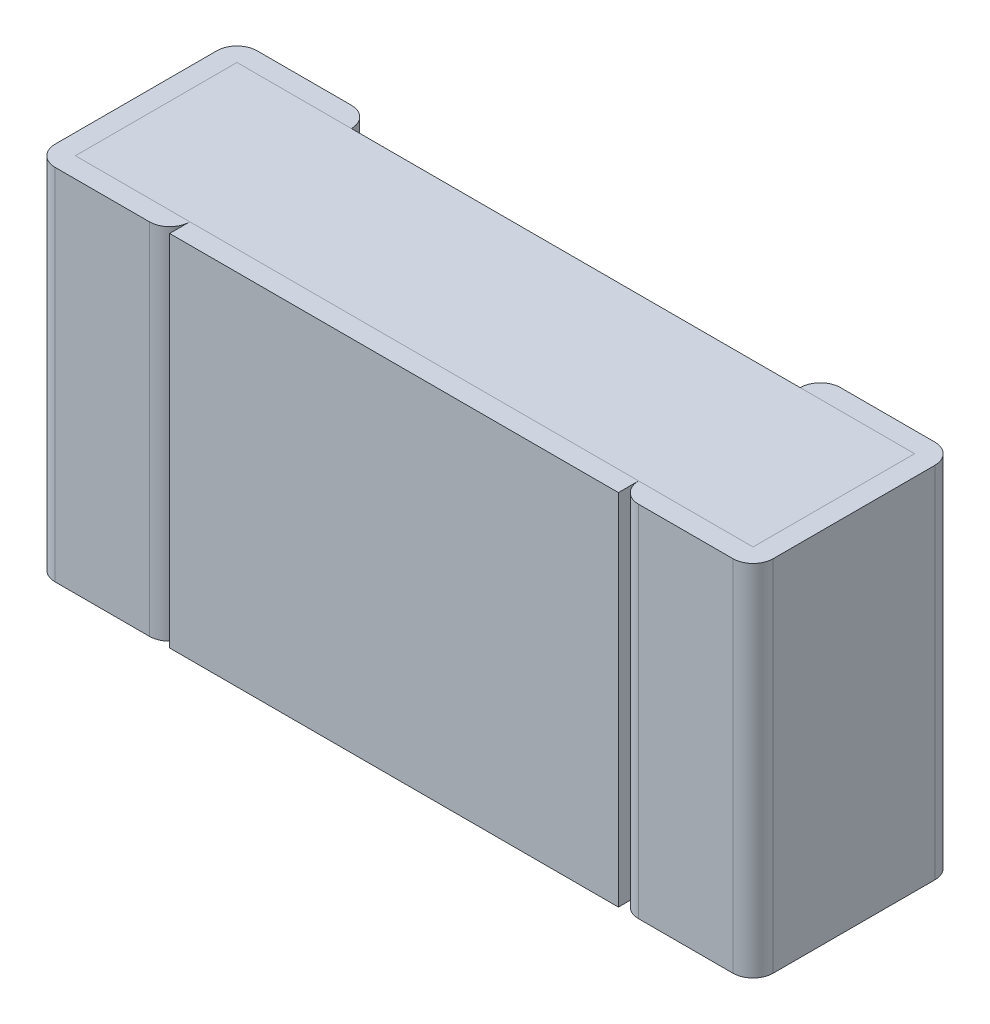
ISO-10303-21;
HEADER;
FILE_DESCRIPTION(('STEP AP214'),'2;1');
FILE_NAME('part.step','',(''),(''),'','','');
FILE_SCHEMA(('AUTOMOTIVE_DESIGN { 1 0 10303 214 1 1 1 1 }'));
ENDSEC;
DATA;
#1=APPLICATION_CONTEXT('core data for automotive mechanical design processes');
#2=APPLICATION_PROTOCOL_DEFINITION('international standard','automotive_design',2000,#1);
#3=PRODUCT_CONTEXT('',#1,'mechanical');
#4=PRODUCT('Part','Part','',(#3));
#5=PRODUCT_RELATED_PRODUCT_CATEGORY('part','',(#4));
#6=PRODUCT_DEFINITION_FORMATION('','',#4);
#7=PRODUCT_DEFINITION_CONTEXT('part definition',#1,'design');
#8=PRODUCT_DEFINITION('design','',#6,#7);
#9=PRODUCT_DEFINITION_SHAPE('','',#8);
#10=(LENGTH_UNIT() NAMED_UNIT(*) SI_UNIT(.MILLI.,.METRE.));
#11=(NAMED_UNIT(*) PLANE_ANGLE_UNIT() SI_UNIT($,.RADIAN.));
#12=(NAMED_UNIT(*) SI_UNIT($,.STERADIAN.) SOLID_ANGLE_UNIT());
#13=UNCERTAINTY_MEASURE_WITH_UNIT(LENGTH_MEASURE(1.E-05),#10,'distance_accuracy_value','');
#14=(GEOMETRIC_REPRESENTATION_CONTEXT(3) GLOBAL_UNCERTAINTY_ASSIGNED_CONTEXT((#13)) GLOBAL_UNIT_ASSIGNED_CONTEXT((#10,
#11,#12)) REPRESENTATION_CONTEXT('',''));
#15=CARTESIAN_POINT('',(0.,0.,0.));
#16=DIRECTION('',(0.,0.,1.));
#17=DIRECTION('',(1.,0.,0.));
#18=AXIS2_PLACEMENT_3D('',#15,#16,#17);
#19=CARTESIAN_POINT('',(-0.5,-0.4,0.45));
#20=DIRECTION('',(0.,0.,1.));
#21=DIRECTION('',(1.,0.,0.));
#22=AXIS2_PLACEMENT_3D('',#19,#20,#21);
#23=PLANE('',#22);
#24=DIRECTION('',(0.,1.,0.));
#25=VECTOR('',#24,1.);
#26=CARTESIAN_POINT('',(-0.5,-0.4,0.45));
#27=LINE('',#26,#25);
#28=CARTESIAN_POINT('',(-0.5,-0.4,0.45));
#29=VERTEX_POINT('',#28);
#30=CARTESIAN_POINT('',(-0.5,0.4,0.45));
#31=VERTEX_POINT('',#30);
#32=EDGE_CURVE('E399',#29,#31,#27,.T.);
#33=ORIENTED_EDGE('',*,*,#32,.F.);
#34=DIRECTION('',(1.,0.,0.));
#35=VECTOR('',#34,1.);
#36=CARTESIAN_POINT('',(-0.5,-0.4,0.45));
#37=LINE('',#36,#35);
#38=CARTESIAN_POINT('',(0.5,-0.4,0.45));
#39=VERTEX_POINT('',#38);
#40=EDGE_CURVE('E228',#29,#39,#37,.T.);
#41=ORIENTED_EDGE('',*,*,#40,.T.);
#42=DIRECTION('',(0.,1.,0.));
#43=VECTOR('',#42,1.);
#44=CARTESIAN_POINT('',(0.5,-0.4,0.45));
#45=LINE('',#44,#43);
#46=CARTESIAN_POINT('',(0.5,0.4,0.45));
#47=VERTEX_POINT('',#46);
#48=EDGE_CURVE('E11',#39,#47,#45,.T.);
#49=ORIENTED_EDGE('',*,*,#48,.T.);
#50=DIRECTION('',(1.,0.,0.));
#51=VECTOR('',#50,1.);
#52=CARTESIAN_POINT('',(-0.5,0.4,0.45));
#53=LINE('',#52,#51);
#54=EDGE_CURVE('E371',#31,#47,#53,.T.);
#55=ORIENTED_EDGE('',*,*,#54,.F.);
#56=EDGE_LOOP('',(#33,#41,#49,#55));
#57=FACE_BOUND('',#56,.T.);
#58=ADVANCED_FACE('F17',(#57),#23,.T.);
#59=CARTESIAN_POINT('',(0.5,-0.4,0.405));
#60=DIRECTION('',(1.,0.,0.));
#61=DIRECTION('',(0.,1.,0.));
#62=AXIS2_PLACEMENT_3D('',#59,#60,#61);
#63=PLANE('',#62);
#64=DIRECTION('',(0.,0.,1.));
#65=VECTOR('',#64,1.);
#66=CARTESIAN_POINT('',(0.5,-0.4,0.405));
#67=LINE('',#66,#65);
#68=CARTESIAN_POINT('',(0.5,-0.4,0.405));
#69=VERTEX_POINT('',#68);
#70=EDGE_CURVE('E224',#69,#39,#67,.T.);
#71=ORIENTED_EDGE('',*,*,#70,.F.);
#72=DIRECTION('',(0.,1.,0.));
#73=VECTOR('',#72,1.);
#74=CARTESIAN_POINT('',(0.5,-0.4,0.405));
#75=LINE('',#74,#73);
#76=CARTESIAN_POINT('',(0.5,0.4,0.405));
#77=VERTEX_POINT('',#76);
#78=EDGE_CURVE('E28',#69,#77,#75,.T.);
#79=ORIENTED_EDGE('',*,*,#78,.T.);
#80=DIRECTION('',(0.,0.,1.));
#81=VECTOR('',#80,1.);
#82=CARTESIAN_POINT('',(0.5,0.4,0.405));
#83=LINE('',#82,#81);
#84=EDGE_CURVE('E209',#77,#47,#83,.T.);
#85=ORIENTED_EDGE('',*,*,#84,.T.);
#86=ORIENTED_EDGE('',*,*,#48,.F.);
#87=EDGE_LOOP('',(#71,#79,#85,#86));
#88=FACE_BOUND('',#87,.T.);
#89=ADVANCED_FACE('F459',(#88),#63,.T.);
#90=CARTESIAN_POINT('',(0.545,-0.4,0.405));
#91=DIRECTION('',(0.,1.,0.));
#92=DIRECTION('',(-1.,0.,0.));
#93=AXIS2_PLACEMENT_3D('',#90,#91,#92);
#94=CYLINDRICAL_SURFACE('',#93,0.045);
#95=CARTESIAN_POINT('',(0.545,-0.4,0.405));
#96=DIRECTION('',(0.,1.,0.));
#97=DIRECTION('',(0.,0.,1.));
#98=AXIS2_PLACEMENT_3D('',#95,#96,#97);
#99=CIRCLE('',#98,0.045);
#100=CARTESIAN_POINT('',(0.545,-0.4,0.45));
#101=VERTEX_POINT('',#100);
#102=EDGE_CURVE('E188',#69,#101,#99,.T.);
#103=ORIENTED_EDGE('',*,*,#102,.T.);
#104=DIRECTION('',(0.,1.,0.));
#105=VECTOR('',#104,1.);
#106=CARTESIAN_POINT('',(0.545,-0.4,0.45));
#107=LINE('',#106,#105);
#108=CARTESIAN_POINT('',(0.545,0.4,0.45));
#109=VERTEX_POINT('',#108);
#110=EDGE_CURVE('E173',#101,#109,#107,.T.);
#111=ORIENTED_EDGE('',*,*,#110,.T.);
#112=CARTESIAN_POINT('',(0.545,0.4,0.405));
#113=DIRECTION('',(0.,1.,0.));
#114=DIRECTION('',(0.,0.,1.));
#115=AXIS2_PLACEMENT_3D('',#112,#113,#114);
#116=CIRCLE('',#115,0.045);
#117=EDGE_CURVE('E239',#77,#109,#116,.T.);
#118=ORIENTED_EDGE('',*,*,#117,.F.);
#119=ORIENTED_EDGE('',*,*,#78,.F.);
#120=EDGE_LOOP('',(#103,#111,#118,#119));
#121=FACE_BOUND('',#120,.T.);
#122=ADVANCED_FACE('F189',(#121),#94,.T.);
#123=CARTESIAN_POINT('',(0.5,-0.4,0.45));
#124=DIRECTION('',(0.,0.,1.));
#125=DIRECTION('',(1.,0.,0.));
#126=AXIS2_PLACEMENT_3D('',#123,#124,#125);
#127=PLANE('',#126);
#128=DIRECTION('',(1.,0.,0.));
#129=VECTOR('',#128,1.);
#130=CARTESIAN_POINT('',(0.5,0.4,0.45));
#131=LINE('',#130,#129);
#132=CARTESIAN_POINT('',(0.755,0.4,0.45));
#133=VERTEX_POINT('',#132);
#134=EDGE_CURVE('E21',#109,#133,#131,.T.);
#135=ORIENTED_EDGE('',*,*,#134,.F.);
#136=ORIENTED_EDGE('',*,*,#110,.F.);
#137=DIRECTION('',(1.,0.,0.));
#138=VECTOR('',#137,1.);
#139=CARTESIAN_POINT('',(0.5,-0.4,0.45));
#140=LINE('',#139,#138);
#141=CARTESIAN_POINT('',(0.755,-0.4,0.45));
#142=VERTEX_POINT('',#141);
#143=EDGE_CURVE('E177',#101,#142,#140,.T.);
#144=ORIENTED_EDGE('',*,*,#143,.T.);
#145=DIRECTION('',(0.,1.,0.));
#146=VECTOR('',#145,1.);
#147=CARTESIAN_POINT('',(0.755,-0.4,0.45));
#148=LINE('',#147,#146);
#149=EDGE_CURVE('E184',#142,#133,#148,.T.);
#150=ORIENTED_EDGE('',*,*,#149,.T.);
#151=EDGE_LOOP('',(#135,#136,#144,#150));
#152=FACE_BOUND('',#151,.T.);
#153=ADVANCED_FACE('F175',(#152),#127,.T.);
#154=CARTESIAN_POINT('',(0.755,-0.4,0.405));
#155=DIRECTION('',(0.,1.,0.));
#156=DIRECTION('',(1.,0.,0.));
#157=AXIS2_PLACEMENT_3D('',#154,#155,#156);
#158=CYLINDRICAL_SURFACE('',#157,0.045);
#159=DIRECTION('',(0.,1.,0.));
#160=VECTOR('',#159,1.);
#161=CARTESIAN_POINT('',(0.8,-0.4,0.405));
#162=LINE('',#161,#160);
#163=CARTESIAN_POINT('',(0.8,-0.4,0.405));
#164=VERTEX_POINT('',#163);
#165=CARTESIAN_POINT('',(0.8,0.4,0.405));
#166=VERTEX_POINT('',#165);
#167=EDGE_CURVE('E307',#164,#166,#162,.T.);
#168=ORIENTED_EDGE('',*,*,#167,.T.);
#169=CARTESIAN_POINT('',(0.755,0.4,0.405));
#170=DIRECTION('',(0.,-1.,0.));
#171=DIRECTION('',(0.,0.,1.));
#172=AXIS2_PLACEMENT_3D('',#169,#170,#171);
#173=CIRCLE('',#172,0.045);
#174=EDGE_CURVE('E408',#166,#133,#173,.T.);
#175=ORIENTED_EDGE('',*,*,#174,.T.);
#176=ORIENTED_EDGE('',*,*,#149,.F.);
#177=CARTESIAN_POINT('',(0.755,-0.4,0.405));
#178=DIRECTION('',(0.,-1.,0.));
#179=DIRECTION('',(0.,0.,1.));
#180=AXIS2_PLACEMENT_3D('',#177,#178,#179);
#181=CIRCLE('',#180,0.045);
#182=EDGE_CURVE('E200',#164,#142,#181,.T.);
#183=ORIENTED_EDGE('',*,*,#182,.F.);
#184=EDGE_LOOP('',(#168,#175,#176,#183));
#185=FACE_BOUND('',#184,.T.);
#186=ADVANCED_FACE('F417',(#185),#158,.T.);
#187=CARTESIAN_POINT('',(0.8,-0.4,0.));
#188=DIRECTION('',(1.,0.,0.));
#189=DIRECTION('',(0.,1.,0.));
#190=AXIS2_PLACEMENT_3D('',#187,#188,#189);
#191=PLANE('',#190);
#192=DIRECTION('',(0.,0.,1.));
#193=VECTOR('',#192,1.);
#194=CARTESIAN_POINT('',(0.8,-0.4,0.));
#195=LINE('',#194,#193);
#196=CARTESIAN_POINT('',(0.8,-0.4,0.045));
#197=VERTEX_POINT('',#196);
#198=EDGE_CURVE('E206',#197,#164,#195,.T.);
#199=ORIENTED_EDGE('',*,*,#198,.F.);
#200=DIRECTION('',(0.,1.,0.));
#201=VECTOR('',#200,1.);
#202=CARTESIAN_POINT('',(0.8,-0.4,0.045));
#203=LINE('',#202,#201);
#204=CARTESIAN_POINT('',(0.8,0.4,0.045));
#205=VERTEX_POINT('',#204);
#206=EDGE_CURVE('E304',#197,#205,#203,.T.);
#207=ORIENTED_EDGE('',*,*,#206,.T.);
#208=DIRECTION('',(0.,0.,1.));
#209=VECTOR('',#208,1.);
#210=CARTESIAN_POINT('',(0.8,0.4,0.));
#211=LINE('',#210,#209);
#212=EDGE_CURVE('E411',#205,#166,#211,.T.);
#213=ORIENTED_EDGE('',*,*,#212,.T.);
#214=ORIENTED_EDGE('',*,*,#167,.F.);
#215=EDGE_LOOP('',(#199,#207,#213,#214));
#216=FACE_BOUND('',#215,.T.);
#217=ADVANCED_FACE('F424',(#216),#191,.T.);
#218=CARTESIAN_POINT('',(0.755,-0.4,0.045));
#219=DIRECTION('',(0.,1.,0.));
#220=DIRECTION('',(1.,0.,0.));
#221=AXIS2_PLACEMENT_3D('',#218,#219,#220);
#222=CYLINDRICAL_SURFACE('',#221,0.045);
#223=CARTESIAN_POINT('',(0.755,-0.4,0.045));
#224=DIRECTION('',(0.,1.,0.));
#225=DIRECTION('',(0.,0.,1.));
#226=AXIS2_PLACEMENT_3D('',#223,#224,#225);
#227=CIRCLE('',#226,0.045);
#228=CARTESIAN_POINT('',(0.755,-0.4,0.));
#229=VERTEX_POINT('',#228);
#230=EDGE_CURVE('E343',#197,#229,#227,.T.);
#231=ORIENTED_EDGE('',*,*,#230,.T.);
#232=DIRECTION('',(0.,1.,0.));
#233=VECTOR('',#232,1.);
#234=CARTESIAN_POINT('',(0.755,-0.4,0.));
#235=LINE('',#234,#233);
#236=CARTESIAN_POINT('',(0.755,0.4,0.));
#237=VERTEX_POINT('',#236);
#238=EDGE_CURVE('E290',#229,#237,#235,.T.);
#239=ORIENTED_EDGE('',*,*,#238,.T.);
#240=CARTESIAN_POINT('',(0.755,0.4,0.045));
#241=DIRECTION('',(0.,1.,0.));
#242=DIRECTION('',(0.,0.,1.));
#243=AXIS2_PLACEMENT_3D('',#240,#241,#242);
#244=CIRCLE('',#243,0.045);
#245=EDGE_CURVE('E375',#205,#237,#244,.T.);
#246=ORIENTED_EDGE('',*,*,#245,.F.);
#247=ORIENTED_EDGE('',*,*,#206,.F.);
#248=EDGE_LOOP('',(#231,#239,#246,#247));
#249=FACE_BOUND('',#248,.T.);
#250=ADVANCED_FACE('F531',(#249),#222,.T.);
#251=CARTESIAN_POINT('',(0.5,-0.4,0.));
#252=DIRECTION('',(0.,0.,1.));
#253=DIRECTION('',(1.,0.,0.));
#254=AXIS2_PLACEMENT_3D('',#251,#252,#253);
#255=PLANE('',#254);
#256=ORIENTED_EDGE('',*,*,#238,.F.);
#257=DIRECTION('',(1.,0.,0.));
#258=VECTOR('',#257,1.);
#259=CARTESIAN_POINT('',(0.5,-0.4,0.));
#260=LINE('',#259,#258);
#261=CARTESIAN_POINT('',(0.545,-0.4,0.));
#262=VERTEX_POINT('',#261);
#263=EDGE_CURVE('E229',#262,#229,#260,.T.);
#264=ORIENTED_EDGE('',*,*,#263,.F.);
#265=DIRECTION('',(0.,1.,0.));
#266=VECTOR('',#265,1.);
#267=CARTESIAN_POINT('',(0.545,-0.4,0.));
#268=LINE('',#267,#266);
#269=CARTESIAN_POINT('',(0.545,0.4,0.));
#270=VERTEX_POINT('',#269);
#271=EDGE_CURVE('E288',#262,#270,#268,.T.);
#272=ORIENTED_EDGE('',*,*,#271,.T.);
#273=DIRECTION('',(1.,0.,0.));
#274=VECTOR('',#273,1.);
#275=CARTESIAN_POINT('',(0.5,0.4,0.));
#276=LINE('',#275,#274);
#277=EDGE_CURVE('E328',#270,#237,#276,.T.);
#278=ORIENTED_EDGE('',*,*,#277,.T.);
#279=EDGE_LOOP('',(#256,#264,#272,#278));
#280=FACE_BOUND('',#279,.T.);
#281=ADVANCED_FACE('F512',(#280),#255,.F.);
#282=CARTESIAN_POINT('',(0.545,-0.4,0.045));
#283=DIRECTION('',(0.,1.,0.));
#284=DIRECTION('',(-1.,0.,0.));
#285=AXIS2_PLACEMENT_3D('',#282,#283,#284);
#286=CYLINDRICAL_SURFACE('',#285,0.045);
#287=DIRECTION('',(0.,1.,0.));
#288=VECTOR('',#287,1.);
#289=CARTESIAN_POINT('',(0.5,-0.4,0.045));
#290=LINE('',#289,#288);
#291=CARTESIAN_POINT('',(0.5,-0.4,0.045));
#292=VERTEX_POINT('',#291);
#293=CARTESIAN_POINT('',(0.5,0.4,0.045));
#294=VERTEX_POINT('',#293);
#295=EDGE_CURVE('E388',#292,#294,#290,.T.);
#296=ORIENTED_EDGE('',*,*,#295,.T.);
#297=CARTESIAN_POINT('',(0.545,0.4,0.045));
#298=DIRECTION('',(0.,-1.,0.));
#299=DIRECTION('',(0.,0.,1.));
#300=AXIS2_PLACEMENT_3D('',#297,#298,#299);
#301=CIRCLE('',#300,0.045);
#302=EDGE_CURVE('E242',#294,#270,#301,.T.);
#303=ORIENTED_EDGE('',*,*,#302,.T.);
#304=ORIENTED_EDGE('',*,*,#271,.F.);
#305=CARTESIAN_POINT('',(0.545,-0.4,0.045));
#306=DIRECTION('',(0.,-1.,0.));
#307=DIRECTION('',(0.,0.,1.));
#308=AXIS2_PLACEMENT_3D('',#305,#306,#307);
#309=CIRCLE('',#308,0.045);
#310=EDGE_CURVE('E195',#292,#262,#309,.T.);
#311=ORIENTED_EDGE('',*,*,#310,.F.);
#312=EDGE_LOOP('',(#296,#303,#304,#311));
#313=FACE_BOUND('',#312,.T.);
#314=ADVANCED_FACE('F507',(#313),#286,.T.);
#315=CARTESIAN_POINT('',(-0.5,0.4,0.405));
#316=DIRECTION('',(0.,1.,0.));
#317=DIRECTION('',(1.,0.,0.));
#318=AXIS2_PLACEMENT_3D('',#315,#316,#317);
#319=PLANE('',#318);
#320=DIRECTION('',(1.,0.,0.));
#321=VECTOR('',#320,1.);
#322=CARTESIAN_POINT('',(-0.5,0.4,0.405));
#323=LINE('',#322,#321);
#324=CARTESIAN_POINT('',(-0.5,0.4,0.405));
#325=VERTEX_POINT('',#324);
#326=EDGE_CURVE('E212',#325,#77,#323,.T.);
#327=ORIENTED_EDGE('',*,*,#326,.F.);
#328=DIRECTION('',(0.,0.,1.));
#329=VECTOR('',#328,1.);
#330=CARTESIAN_POINT('',(-0.5,0.4,0.405));
#331=LINE('',#330,#329);
#332=EDGE_CURVE('E286',#325,#31,#331,.T.);
#333=ORIENTED_EDGE('',*,*,#332,.T.);
#334=ORIENTED_EDGE('',*,*,#54,.T.);
#335=ORIENTED_EDGE('',*,*,#84,.F.);
#336=EDGE_LOOP('',(#327,#333,#334,#335));
#337=FACE_BOUND('',#336,.T.);
#338=ADVANCED_FACE('F511',(#337),#319,.T.);
#339=CARTESIAN_POINT('',(0.5,0.4,0.));
#340=DIRECTION('',(0.,1.,0.));
#341=DIRECTION('',(1.,0.,0.));
#342=AXIS2_PLACEMENT_3D('',#339,#340,#341);
#343=PLANE('',#342);
#344=ORIENTED_EDGE('',*,*,#277,.F.);
#345=ORIENTED_EDGE('',*,*,#302,.F.);
#346=DIRECTION('',(1.,0.,0.));
#347=VECTOR('',#346,1.);
#348=CARTESIAN_POINT('',(-0.755,0.4,0.045));
#349=LINE('',#348,#347);
#350=CARTESIAN_POINT('',(0.755,0.4,0.045));
#351=VERTEX_POINT('',#350);
#352=EDGE_CURVE('E352',#294,#351,#349,.T.);
#353=ORIENTED_EDGE('',*,*,#352,.T.);
#354=DIRECTION('',(0.,0.,1.));
#355=VECTOR('',#354,1.);
#356=CARTESIAN_POINT('',(0.755,0.4,0.045));
#357=LINE('',#356,#355);
#358=CARTESIAN_POINT('',(0.755,0.4,0.405));
#359=VERTEX_POINT('',#358);
#360=EDGE_CURVE('E348',#351,#359,#357,.T.);
#361=ORIENTED_EDGE('',*,*,#360,.T.);
#362=DIRECTION('',(1.,0.,0.));
#363=VECTOR('',#362,1.);
#364=CARTESIAN_POINT('',(-0.755,0.4,0.405));
#365=LINE('',#364,#363);
#366=EDGE_CURVE('E216',#77,#359,#365,.T.);
#367=ORIENTED_EDGE('',*,*,#366,.F.);
#368=ORIENTED_EDGE('',*,*,#117,.T.);
#369=ORIENTED_EDGE('',*,*,#134,.T.);
#370=ORIENTED_EDGE('',*,*,#174,.F.);
#371=ORIENTED_EDGE('',*,*,#212,.F.);
#372=ORIENTED_EDGE('',*,*,#245,.T.);
#373=EDGE_LOOP('',(#344,#345,#353,#361,#367,#368,#369,#370,#371,#372));
#374=FACE_BOUND('',#373,.T.);
#375=ADVANCED_FACE('F432',(#374),#343,.T.);
#376=CARTESIAN_POINT('',(-0.5,-0.4,0.405));
#377=DIRECTION('',(1.,0.,0.));
#378=DIRECTION('',(0.,1.,0.));
#379=AXIS2_PLACEMENT_3D('',#376,#377,#378);
#380=PLANE('',#379);
#381=ORIENTED_EDGE('',*,*,#32,.T.);
#382=ORIENTED_EDGE('',*,*,#332,.F.);
#383=DIRECTION('',(0.,1.,0.));
#384=VECTOR('',#383,1.);
#385=CARTESIAN_POINT('',(-0.5,-0.4,0.405));
#386=LINE('',#385,#384);
#387=CARTESIAN_POINT('',(-0.5,-0.4,0.405));
#388=VERTEX_POINT('',#387);
#389=EDGE_CURVE('E217',#388,#325,#386,.T.);
#390=ORIENTED_EDGE('',*,*,#389,.F.);
#391=DIRECTION('',(0.,0.,1.));
#392=VECTOR('',#391,1.);
#393=CARTESIAN_POINT('',(-0.5,-0.4,0.405));
#394=LINE('',#393,#392);
#395=EDGE_CURVE('E337',#388,#29,#394,.T.);
#396=ORIENTED_EDGE('',*,*,#395,.T.);
#397=EDGE_LOOP('',(#381,#382,#390,#396));
#398=FACE_BOUND('',#397,.T.);
#399=ADVANCED_FACE('F496',(#398),#380,.F.);
#400=CARTESIAN_POINT('',(-0.5,-0.4,0.405));
#401=DIRECTION('',(0.,1.,0.));
#402=DIRECTION('',(1.,0.,0.));
#403=AXIS2_PLACEMENT_3D('',#400,#401,#402);
#404=PLANE('',#403);
#405=ORIENTED_EDGE('',*,*,#70,.T.);
#406=ORIENTED_EDGE('',*,*,#40,.F.);
#407=ORIENTED_EDGE('',*,*,#395,.F.);
#408=DIRECTION('',(1.,0.,0.));
#409=VECTOR('',#408,1.);
#410=CARTESIAN_POINT('',(-0.5,-0.4,0.405));
#411=LINE('',#410,#409);
#412=EDGE_CURVE('E312',#388,#69,#411,.T.);
#413=ORIENTED_EDGE('',*,*,#412,.T.);
#414=EDGE_LOOP('',(#405,#406,#407,#413));
#415=FACE_BOUND('',#414,.T.);
#416=ADVANCED_FACE('F500',(#415),#404,.F.);
#417=CARTESIAN_POINT('',(0.5,-0.4,0.));
#418=DIRECTION('',(0.,1.,0.));
#419=DIRECTION('',(1.,0.,0.));
#420=AXIS2_PLACEMENT_3D('',#417,#418,#419);
#421=PLANE('',#420);
#422=ORIENTED_EDGE('',*,*,#230,.F.);
#423=ORIENTED_EDGE('',*,*,#198,.T.);
#424=ORIENTED_EDGE('',*,*,#182,.T.);
#425=ORIENTED_EDGE('',*,*,#143,.F.);
#426=ORIENTED_EDGE('',*,*,#102,.F.);
#427=DIRECTION('',(1.,0.,0.));
#428=VECTOR('',#427,1.);
#429=CARTESIAN_POINT('',(-0.755,-0.4,0.405));
#430=LINE('',#429,#428);
#431=CARTESIAN_POINT('',(0.755,-0.4,0.405));
#432=VERTEX_POINT('',#431);
#433=EDGE_CURVE('E368',#69,#432,#430,.T.);
#434=ORIENTED_EDGE('',*,*,#433,.T.);
#435=DIRECTION('',(0.,0.,1.));
#436=VECTOR('',#435,1.);
#437=CARTESIAN_POINT('',(0.755,-0.4,0.045));
#438=LINE('',#437,#436);
#439=CARTESIAN_POINT('',(0.755,-0.4,0.045));
#440=VERTEX_POINT('',#439);
#441=EDGE_CURVE('E303',#440,#432,#438,.T.);
#442=ORIENTED_EDGE('',*,*,#441,.F.);
#443=DIRECTION('',(1.,0.,0.));
#444=VECTOR('',#443,1.);
#445=CARTESIAN_POINT('',(-0.755,-0.4,0.045));
#446=LINE('',#445,#444);
#447=EDGE_CURVE('E298',#292,#440,#446,.T.);
#448=ORIENTED_EDGE('',*,*,#447,.F.);
#449=ORIENTED_EDGE('',*,*,#310,.T.);
#450=ORIENTED_EDGE('',*,*,#263,.T.);
#451=EDGE_LOOP('',(#422,#423,#424,#425,#426,#434,#442,#448,#449,#450));
#452=FACE_BOUND('',#451,.T.);
#453=ADVANCED_FACE('F197',(#452),#421,.F.);
#454=CARTESIAN_POINT('',(-0.755,-0.4,0.045));
#455=DIRECTION('',(0.,0.,1.));
#456=DIRECTION('',(1.,0.,0.));
#457=AXIS2_PLACEMENT_3D('',#454,#455,#456);
#458=PLANE('',#457);
#459=DIRECTION('',(1.,0.,0.));
#460=VECTOR('',#459,1.);
#461=CARTESIAN_POINT('',(-0.755,0.4,0.045));
#462=LINE('',#461,#460);
#463=CARTESIAN_POINT('',(-0.5,0.4,0.045));
#464=VERTEX_POINT('',#463);
#465=EDGE_CURVE('E741',#464,#294,#462,.T.);
#466=ORIENTED_EDGE('',*,*,#465,.T.);
#467=ORIENTED_EDGE('',*,*,#295,.F.);
#468=DIRECTION('',(1.,0.,0.));
#469=VECTOR('',#468,1.);
#470=CARTESIAN_POINT('',(-0.755,-0.4,0.045));
#471=LINE('',#470,#469);
#472=CARTESIAN_POINT('',(-0.5,-0.4,0.045));
#473=VERTEX_POINT('',#472);
#474=EDGE_CURVE('E294',#473,#292,#471,.T.);
#475=ORIENTED_EDGE('',*,*,#474,.F.);
#476=DIRECTION('',(0.,1.,0.));
#477=VECTOR('',#476,1.);
#478=CARTESIAN_POINT('',(-0.5,-0.4,0.045));
#479=LINE('',#478,#477);
#480=EDGE_CURVE('E299',#473,#464,#479,.T.);
#481=ORIENTED_EDGE('',*,*,#480,.T.);
#482=EDGE_LOOP('',(#466,#467,#475,#481));
#483=FACE_BOUND('',#482,.T.);
#484=ADVANCED_FACE('F551',(#483),#458,.F.);
#485=CARTESIAN_POINT('',(-0.755,0.4,0.045));
#486=DIRECTION('',(0.,1.,0.));
#487=DIRECTION('',(1.,0.,0.));
#488=AXIS2_PLACEMENT_3D('',#485,#486,#487);
#489=PLANE('',#488);
#490=DIRECTION('',(1.,0.,0.));
#491=VECTOR('',#490,1.);
#492=CARTESIAN_POINT('',(-0.755,0.4,0.045));
#493=LINE('',#492,#491);
#494=CARTESIAN_POINT('',(-0.755,0.4,0.045));
#495=VERTEX_POINT('',#494);
#496=EDGE_CURVE('E218',#495,#464,#493,.T.);
#497=ORIENTED_EDGE('',*,*,#496,.F.);
#498=DIRECTION('',(0.,0.,1.));
#499=VECTOR('',#498,1.);
#500=CARTESIAN_POINT('',(-0.755,0.4,0.045));
#501=LINE('',#500,#499);
#502=CARTESIAN_POINT('',(-0.755,0.4,0.405));
#503=VERTEX_POINT('',#502);
#504=EDGE_CURVE('E223',#495,#503,#501,.T.);
#505=ORIENTED_EDGE('',*,*,#504,.T.);
#506=DIRECTION('',(1.,0.,0.));
#507=VECTOR('',#506,1.);
#508=CARTESIAN_POINT('',(-0.755,0.4,0.405));
#509=LINE('',#508,#507);
#510=EDGE_CURVE('E256',#503,#325,#509,.T.);
#511=ORIENTED_EDGE('',*,*,#510,.T.);
#512=ORIENTED_EDGE('',*,*,#326,.T.);
#513=ORIENTED_EDGE('',*,*,#366,.T.);
#514=ORIENTED_EDGE('',*,*,#360,.F.);
#515=ORIENTED_EDGE('',*,*,#352,.F.);
#516=ORIENTED_EDGE('',*,*,#465,.F.);
#517=EDGE_LOOP('',(#497,#505,#511,#512,#513,#514,#515,#516));
#518=FACE_BOUND('',#517,.T.);
#519=ADVANCED_FACE('F547',(#518),#489,.T.);
#520=CARTESIAN_POINT('',(-0.545,-0.4,0.405));
#521=DIRECTION('',(0.,1.,0.));
#522=DIRECTION('',(1.,0.,0.));
#523=AXIS2_PLACEMENT_3D('',#520,#521,#522);
#524=CYLINDRICAL_SURFACE('',#523,0.045);
#525=ORIENTED_EDGE('',*,*,#389,.T.);
#526=CARTESIAN_POINT('',(-0.545,0.4,0.405));
#527=DIRECTION('',(0.,-1.,0.));
#528=DIRECTION('',(0.,0.,1.));
#529=AXIS2_PLACEMENT_3D('',#526,#527,#528);
#530=CIRCLE('',#529,0.045);
#531=CARTESIAN_POINT('',(-0.545,0.4,0.45));
#532=VERTEX_POINT('',#531);
#533=EDGE_CURVE('E325',#325,#532,#530,.T.);
#534=ORIENTED_EDGE('',*,*,#533,.T.);
#535=DIRECTION('',(0.,1.,0.));
#536=VECTOR('',#535,1.);
#537=CARTESIAN_POINT('',(-0.545,-0.4,0.45));
#538=LINE('',#537,#536);
#539=CARTESIAN_POINT('',(-0.545,-0.4,0.45));
#540=VERTEX_POINT('',#539);
#541=EDGE_CURVE('E308',#540,#532,#538,.T.);
#542=ORIENTED_EDGE('',*,*,#541,.F.);
#543=CARTESIAN_POINT('',(-0.545,-0.4,0.405));
#544=DIRECTION('',(0.,-1.,0.));
#545=DIRECTION('',(0.,0.,1.));
#546=AXIS2_PLACEMENT_3D('',#543,#544,#545);
#547=CIRCLE('',#546,0.045);
#548=EDGE_CURVE('E268',#388,#540,#547,.T.);
#549=ORIENTED_EDGE('',*,*,#548,.F.);
#550=EDGE_LOOP('',(#525,#534,#542,#549));
#551=FACE_BOUND('',#550,.T.);
#552=ADVANCED_FACE('F470',(#551),#524,.T.);
#553=CARTESIAN_POINT('',(-0.8,-0.4,0.45));
#554=DIRECTION('',(0.,0.,1.));
#555=DIRECTION('',(1.,0.,0.));
#556=AXIS2_PLACEMENT_3D('',#553,#554,#555);
#557=PLANE('',#556);
#558=DIRECTION('',(1.,0.,0.));
#559=VECTOR('',#558,1.);
#560=CARTESIAN_POINT('',(-0.8,0.4,0.45));
#561=LINE('',#560,#559);
#562=CARTESIAN_POINT('',(-0.755,0.4,0.45));
#563=VERTEX_POINT('',#562);
#564=EDGE_CURVE('E320',#563,#532,#561,.T.);
#565=ORIENTED_EDGE('',*,*,#564,.F.);
#566=DIRECTION('',(0.,1.,0.));
#567=VECTOR('',#566,1.);
#568=CARTESIAN_POINT('',(-0.755,-0.4,0.45));
#569=LINE('',#568,#567);
#570=CARTESIAN_POINT('',(-0.755,-0.4,0.45));
#571=VERTEX_POINT('',#570);
#572=EDGE_CURVE('E357',#571,#563,#569,.T.);
#573=ORIENTED_EDGE('',*,*,#572,.F.);
#574=DIRECTION('',(1.,0.,0.));
#575=VECTOR('',#574,1.);
#576=CARTESIAN_POINT('',(-0.8,-0.4,0.45));
#577=LINE('',#576,#575);
#578=EDGE_CURVE('E250',#571,#540,#577,.T.);
#579=ORIENTED_EDGE('',*,*,#578,.T.);
#580=ORIENTED_EDGE('',*,*,#541,.T.);
#581=EDGE_LOOP('',(#565,#573,#579,#580));
#582=FACE_BOUND('',#581,.T.);
#583=ADVANCED_FACE('F465',(#582),#557,.T.);
#584=CARTESIAN_POINT('',(-0.755,-0.4,0.045));
#585=DIRECTION('',(0.,1.,0.));
#586=DIRECTION('',(1.,0.,0.));
#587=AXIS2_PLACEMENT_3D('',#584,#585,#586);
#588=PLANE('',#587);
#589=ORIENTED_EDGE('',*,*,#474,.T.);
#590=ORIENTED_EDGE('',*,*,#447,.T.);
#591=ORIENTED_EDGE('',*,*,#441,.T.);
#592=ORIENTED_EDGE('',*,*,#433,.F.);
#593=ORIENTED_EDGE('',*,*,#412,.F.);
#594=DIRECTION('',(1.,0.,0.));
#595=VECTOR('',#594,1.);
#596=CARTESIAN_POINT('',(-0.755,-0.4,0.405));
#597=LINE('',#596,#595);
#598=CARTESIAN_POINT('',(-0.755,-0.4,0.405));
#599=VERTEX_POINT('',#598);
#600=EDGE_CURVE('E237',#599,#388,#597,.T.);
#601=ORIENTED_EDGE('',*,*,#600,.F.);
#602=DIRECTION('',(0.,0.,1.));
#603=VECTOR('',#602,1.);
#604=CARTESIAN_POINT('',(-0.755,-0.4,0.045));
#605=LINE('',#604,#603);
#606=CARTESIAN_POINT('',(-0.755,-0.4,0.045));
#607=VERTEX_POINT('',#606);
#608=EDGE_CURVE('E233',#607,#599,#605,.T.);
#609=ORIENTED_EDGE('',*,*,#608,.F.);
#610=DIRECTION('',(1.,0.,0.));
#611=VECTOR('',#610,1.);
#612=CARTESIAN_POINT('',(-0.755,-0.4,0.045));
#613=LINE('',#612,#611);
#614=EDGE_CURVE('E238',#607,#473,#613,.T.);
#615=ORIENTED_EDGE('',*,*,#614,.T.);
#616=EDGE_LOOP('',(#589,#590,#591,#592,#593,#601,#609,#615));
#617=FACE_BOUND('',#616,.T.);
#618=ADVANCED_FACE('F469',(#617),#588,.F.);
#619=CARTESIAN_POINT('',(-0.545,-0.4,0.045));
#620=DIRECTION('',(0.,1.,0.));
#621=DIRECTION('',(1.,0.,0.));
#622=AXIS2_PLACEMENT_3D('',#619,#620,#621);
#623=CYLINDRICAL_SURFACE('',#622,0.045);
#624=CARTESIAN_POINT('',(-0.545,-0.4,0.045));
#625=DIRECTION('',(0.,1.,0.));
#626=DIRECTION('',(0.,0.,1.));
#627=AXIS2_PLACEMENT_3D('',#624,#625,#626);
#628=CIRCLE('',#627,0.045);
#629=CARTESIAN_POINT('',(-0.545,-0.4,0.));
#630=VERTEX_POINT('',#629);
#631=EDGE_CURVE('E266',#473,#630,#628,.T.);
#632=ORIENTED_EDGE('',*,*,#631,.T.);
#633=DIRECTION('',(0.,1.,0.));
#634=VECTOR('',#633,1.);
#635=CARTESIAN_POINT('',(-0.545,-0.4,0.));
#636=LINE('',#635,#634);
#637=CARTESIAN_POINT('',(-0.545,0.4,0.));
#638=VERTEX_POINT('',#637);
#639=EDGE_CURVE('E347',#630,#638,#636,.T.);
#640=ORIENTED_EDGE('',*,*,#639,.T.);
#641=CARTESIAN_POINT('',(-0.545,0.4,0.045));
#642=DIRECTION('',(0.,1.,0.));
#643=DIRECTION('',(0.,0.,1.));
#644=AXIS2_PLACEMENT_3D('',#641,#642,#643);
#645=CIRCLE('',#644,0.045);
#646=EDGE_CURVE('E222',#464,#638,#645,.T.);
#647=ORIENTED_EDGE('',*,*,#646,.F.);
#648=ORIENTED_EDGE('',*,*,#480,.F.);
#649=EDGE_LOOP('',(#632,#640,#647,#648));
#650=FACE_BOUND('',#649,.T.);
#651=ADVANCED_FACE('F489',(#650),#623,.T.);
#652=CARTESIAN_POINT('',(-0.8,-0.4,0.));
#653=DIRECTION('',(0.,0.,1.));
#654=DIRECTION('',(1.,0.,0.));
#655=AXIS2_PLACEMENT_3D('',#652,#653,#654);
#656=PLANE('',#655);
#657=ORIENTED_EDGE('',*,*,#639,.F.);
#658=DIRECTION('',(1.,0.,0.));
#659=VECTOR('',#658,1.);
#660=CARTESIAN_POINT('',(-0.8,-0.4,0.));
#661=LINE('',#660,#659);
#662=CARTESIAN_POINT('',(-0.755,-0.4,0.));
#663=VERTEX_POINT('',#662);
#664=EDGE_CURVE('E392',#663,#630,#661,.T.);
#665=ORIENTED_EDGE('',*,*,#664,.F.);
#666=DIRECTION('',(0.,1.,0.));
#667=VECTOR('',#666,1.);
#668=CARTESIAN_POINT('',(-0.755,-0.4,0.));
#669=LINE('',#668,#667);
#670=CARTESIAN_POINT('',(-0.755,0.4,0.));
#671=VERTEX_POINT('',#670);
#672=EDGE_CURVE('E353',#663,#671,#669,.T.);
#673=ORIENTED_EDGE('',*,*,#672,.T.);
#674=DIRECTION('',(1.,0.,0.));
#675=VECTOR('',#674,1.);
#676=CARTESIAN_POINT('',(-0.8,0.4,0.));
#677=LINE('',#676,#675);
#678=EDGE_CURVE('E316',#671,#638,#677,.T.);
#679=ORIENTED_EDGE('',*,*,#678,.T.);
#680=EDGE_LOOP('',(#657,#665,#673,#679));
#681=FACE_BOUND('',#680,.T.);
#682=ADVANCED_FACE('F561',(#681),#656,.F.);
#683=CARTESIAN_POINT('',(-0.8,0.4,0.));
#684=DIRECTION('',(0.,1.,0.));
#685=DIRECTION('',(1.,0.,0.));
#686=AXIS2_PLACEMENT_3D('',#683,#684,#685);
#687=PLANE('',#686);
#688=ORIENTED_EDGE('',*,*,#678,.F.);
#689=CARTESIAN_POINT('',(-0.755,0.4,0.045));
#690=DIRECTION('',(0.,-1.,0.));
#691=DIRECTION('',(0.,0.,1.));
#692=AXIS2_PLACEMENT_3D('',#689,#690,#691);
#693=CIRCLE('',#692,0.045);
#694=CARTESIAN_POINT('',(-0.8,0.4,0.045));
#695=VERTEX_POINT('',#694);
#696=EDGE_CURVE('E358',#695,#671,#693,.T.);
#697=ORIENTED_EDGE('',*,*,#696,.F.);
#698=DIRECTION('',(0.,0.,1.));
#699=VECTOR('',#698,1.);
#700=CARTESIAN_POINT('',(-0.8,0.4,0.));
#701=LINE('',#700,#699);
#702=CARTESIAN_POINT('',(-0.8,0.4,0.405));
#703=VERTEX_POINT('',#702);
#704=EDGE_CURVE('E260',#695,#703,#701,.T.);
#705=ORIENTED_EDGE('',*,*,#704,.T.);
#706=CARTESIAN_POINT('',(-0.755,0.4,0.405));
#707=DIRECTION('',(0.,1.,0.));
#708=DIRECTION('',(0.,0.,1.));
#709=AXIS2_PLACEMENT_3D('',#706,#707,#708);
#710=CIRCLE('',#709,0.045);
#711=EDGE_CURVE('E321',#703,#563,#710,.T.);
#712=ORIENTED_EDGE('',*,*,#711,.T.);
#713=ORIENTED_EDGE('',*,*,#564,.T.);
#714=ORIENTED_EDGE('',*,*,#533,.F.);
#715=ORIENTED_EDGE('',*,*,#510,.F.);
#716=ORIENTED_EDGE('',*,*,#504,.F.);
#717=ORIENTED_EDGE('',*,*,#496,.T.);
#718=ORIENTED_EDGE('',*,*,#646,.T.);
#719=EDGE_LOOP('',(#688,#697,#705,#712,#713,#714,#715,#716,#717,#718));
#720=FACE_BOUND('',#719,.T.);
#721=ADVANCED_FACE('F19',(#720),#687,.T.);
#722=CARTESIAN_POINT('',(-0.755,-0.4,0.405));
#723=DIRECTION('',(0.,1.,0.));
#724=DIRECTION('',(-1.,0.,0.));
#725=AXIS2_PLACEMENT_3D('',#722,#723,#724);
#726=CYLINDRICAL_SURFACE('',#725,0.045);
#727=CARTESIAN_POINT('',(-0.755,-0.4,0.405));
#728=DIRECTION('',(0.,1.,0.));
#729=DIRECTION('',(0.,0.,1.));
#730=AXIS2_PLACEMENT_3D('',#727,#728,#729);
#731=CIRCLE('',#730,0.045);
#732=CARTESIAN_POINT('',(-0.8,-0.4,0.405));
#733=VERTEX_POINT('',#732);
#734=EDGE_CURVE('E245',#733,#571,#731,.T.);
#735=ORIENTED_EDGE('',*,*,#734,.T.);
#736=ORIENTED_EDGE('',*,*,#572,.T.);
#737=ORIENTED_EDGE('',*,*,#711,.F.);
#738=DIRECTION('',(0.,1.,0.));
#739=VECTOR('',#738,1.);
#740=CARTESIAN_POINT('',(-0.8,-0.4,0.405));
#741=LINE('',#740,#739);
#742=EDGE_CURVE('E257',#733,#703,#741,.T.);
#743=ORIENTED_EDGE('',*,*,#742,.F.);
#744=EDGE_LOOP('',(#735,#736,#737,#743));
#745=FACE_BOUND('',#744,.T.);
#746=ADVANCED_FACE('F447',(#745),#726,.T.);
#747=CARTESIAN_POINT('',(-0.755,-0.4,0.045));
#748=DIRECTION('',(0.,1.,0.));
#749=DIRECTION('',(-1.,0.,0.));
#750=AXIS2_PLACEMENT_3D('',#747,#748,#749);
#751=CYLINDRICAL_SURFACE('',#750,0.045);
#752=DIRECTION('',(0.,1.,0.));
#753=VECTOR('',#752,1.);
#754=CARTESIAN_POINT('',(-0.8,-0.4,0.045));
#755=LINE('',#754,#753);
#756=CARTESIAN_POINT('',(-0.8,-0.4,0.045));
#757=VERTEX_POINT('',#756);
#758=EDGE_CURVE('E267',#757,#695,#755,.T.);
#759=ORIENTED_EDGE('',*,*,#758,.T.);
#760=ORIENTED_EDGE('',*,*,#696,.T.);
#761=ORIENTED_EDGE('',*,*,#672,.F.);
#762=CARTESIAN_POINT('',(-0.755,-0.4,0.045));
#763=DIRECTION('',(0.,-1.,0.));
#764=DIRECTION('',(0.,0.,1.));
#765=AXIS2_PLACEMENT_3D('',#762,#763,#764);
#766=CIRCLE('',#765,0.045);
#767=EDGE_CURVE('E249',#757,#663,#766,.T.);
#768=ORIENTED_EDGE('',*,*,#767,.F.);
#769=EDGE_LOOP('',(#759,#760,#761,#768));
#770=FACE_BOUND('',#769,.T.);
#771=ADVANCED_FACE('F440',(#770),#751,.T.);
#772=CARTESIAN_POINT('',(-0.8,-0.4,0.));
#773=DIRECTION('',(0.,1.,0.));
#774=DIRECTION('',(1.,0.,0.));
#775=AXIS2_PLACEMENT_3D('',#772,#773,#774);
#776=PLANE('',#775);
#777=ORIENTED_EDGE('',*,*,#631,.F.);
#778=ORIENTED_EDGE('',*,*,#614,.F.);
#779=ORIENTED_EDGE('',*,*,#608,.T.);
#780=ORIENTED_EDGE('',*,*,#600,.T.);
#781=ORIENTED_EDGE('',*,*,#548,.T.);
#782=ORIENTED_EDGE('',*,*,#578,.F.);
#783=ORIENTED_EDGE('',*,*,#734,.F.);
#784=DIRECTION('',(0.,0.,1.));
#785=VECTOR('',#784,1.);
#786=CARTESIAN_POINT('',(-0.8,-0.4,0.));
#787=LINE('',#786,#785);
#788=EDGE_CURVE('E262',#757,#733,#787,.T.);
#789=ORIENTED_EDGE('',*,*,#788,.F.);
#790=ORIENTED_EDGE('',*,*,#767,.T.);
#791=ORIENTED_EDGE('',*,*,#664,.T.);
#792=EDGE_LOOP('',(#777,#778,#779,#780,#781,#782,#783,#789,#790,#791));
#793=FACE_BOUND('',#792,.T.);
#794=ADVANCED_FACE('F446',(#793),#776,.F.);
#795=CARTESIAN_POINT('',(-0.8,-0.4,0.));
#796=DIRECTION('',(1.,0.,0.));
#797=DIRECTION('',(0.,1.,0.));
#798=AXIS2_PLACEMENT_3D('',#795,#796,#797);
#799=PLANE('',#798);
#800=ORIENTED_EDGE('',*,*,#742,.T.);
#801=ORIENTED_EDGE('',*,*,#704,.F.);
#802=ORIENTED_EDGE('',*,*,#758,.F.);
#803=ORIENTED_EDGE('',*,*,#788,.T.);
#804=EDGE_LOOP('',(#800,#801,#802,#803));
#805=FACE_BOUND('',#804,.T.);
#806=ADVANCED_FACE('F621',(#805),#799,.F.);
#807=CLOSED_SHELL('',(#58,#89,#122,#153,#186,#217,#250,#281,#314,#338,#375,#399,#416,#453,#484,
#519,#552,#583,#618,#651,#682,#721,#746,#771,#794,#806));
#808=MANIFOLD_SOLID_BREP('B1',#807);
#809=ADVANCED_BREP_SHAPE_REPRESENTATION('',(#18,#808),#14);
#810=SHAPE_DEFINITION_REPRESENTATION(#9,#809);
ENDSEC;
END-ISO-10303-21;
